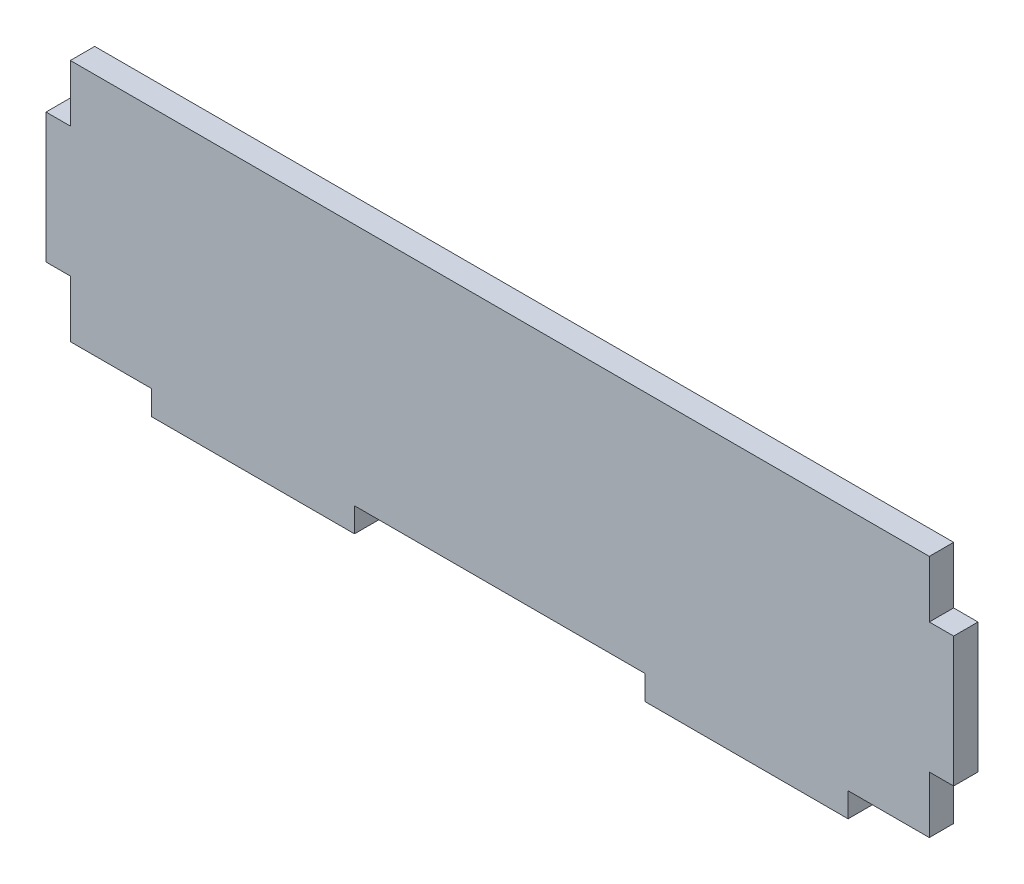
ISO-10303-21;
HEADER;
FILE_DESCRIPTION(('STEP AP214'),'2;1');
FILE_NAME('part.step','',(''),(''),'','','');
FILE_SCHEMA(('AUTOMOTIVE_DESIGN { 1 0 10303 214 1 1 1 1 }'));
ENDSEC;
DATA;
#1=APPLICATION_CONTEXT('core data for automotive mechanical design processes');
#2=APPLICATION_PROTOCOL_DEFINITION('international standard','automotive_design',2000,#1);
#3=PRODUCT_CONTEXT('',#1,'mechanical');
#4=PRODUCT('Part','Part','',(#3));
#5=PRODUCT_RELATED_PRODUCT_CATEGORY('part','',(#4));
#6=PRODUCT_DEFINITION_FORMATION('','',#4);
#7=PRODUCT_DEFINITION_CONTEXT('part definition',#1,'design');
#8=PRODUCT_DEFINITION('design','',#6,#7);
#9=PRODUCT_DEFINITION_SHAPE('','',#8);
#10=(LENGTH_UNIT() NAMED_UNIT(*) SI_UNIT(.MILLI.,.METRE.));
#11=(NAMED_UNIT(*) PLANE_ANGLE_UNIT() SI_UNIT($,.RADIAN.));
#12=(NAMED_UNIT(*) SI_UNIT($,.STERADIAN.) SOLID_ANGLE_UNIT());
#13=UNCERTAINTY_MEASURE_WITH_UNIT(LENGTH_MEASURE(1.E-05),#10,'distance_accuracy_value','');
#14=(GEOMETRIC_REPRESENTATION_CONTEXT(3) GLOBAL_UNCERTAINTY_ASSIGNED_CONTEXT((#13)) GLOBAL_UNIT_ASSIGNED_CONTEXT((#10,
#11,#12)) REPRESENTATION_CONTEXT('',''));
#15=CARTESIAN_POINT('',(0.,0.,0.));
#16=DIRECTION('',(0.,0.,1.));
#17=DIRECTION('',(1.,0.,0.));
#18=AXIS2_PLACEMENT_3D('',#15,#16,#17);
#19=CARTESIAN_POINT('',(0.,7.,3.));
#20=DIRECTION('',(0.,-1.,0.));
#21=DIRECTION('',(0.,0.,-1.));
#22=AXIS2_PLACEMENT_3D('',#19,#20,#21);
#23=PLANE('',#22);
#24=DIRECTION('',(-1.,0.,0.));
#25=VECTOR('',#24,1.);
#26=CARTESIAN_POINT('',(0.,7.,0.));
#27=LINE('',#26,#25);
#28=CARTESIAN_POINT('',(6.50000000000001,7.,0.));
#29=VERTEX_POINT('',#28);
#30=CARTESIAN_POINT('',(3.50000000000001,7.,0.));
#31=VERTEX_POINT('',#30);
#32=EDGE_CURVE('E214',#29,#31,#27,.T.);
#33=ORIENTED_EDGE('',*,*,#32,.F.);
#34=DIRECTION('',(0.,0.,-1.));
#35=VECTOR('',#34,1.);
#36=CARTESIAN_POINT('',(6.50000000000001,7.,3.));
#37=LINE('',#36,#35);
#38=CARTESIAN_POINT('',(6.50000000000001,7.,3.));
#39=VERTEX_POINT('',#38);
#40=EDGE_CURVE('E11',#39,#29,#37,.T.);
#41=ORIENTED_EDGE('',*,*,#40,.F.);
#42=DIRECTION('',(-1.,0.,0.));
#43=VECTOR('',#42,1.);
#44=CARTESIAN_POINT('',(0.,7.,3.));
#45=LINE('',#44,#43);
#46=CARTESIAN_POINT('',(3.50000000000001,7.,3.));
#47=VERTEX_POINT('',#46);
#48=EDGE_CURVE('E287',#39,#47,#45,.T.);
#49=ORIENTED_EDGE('',*,*,#48,.T.);
#50=DIRECTION('',(0.,0.,-1.));
#51=VECTOR('',#50,1.);
#52=CARTESIAN_POINT('',(3.50000000000001,7.,3.));
#53=LINE('',#52,#51);
#54=EDGE_CURVE('E58',#47,#31,#53,.T.);
#55=ORIENTED_EDGE('',*,*,#54,.T.);
#56=EDGE_LOOP('',(#33,#41,#49,#55));
#57=FACE_BOUND('',#56,.T.);
#58=ADVANCED_FACE('F41',(#57),#23,.T.);
#59=CARTESIAN_POINT('',(6.50000000000001,0.,3.));
#60=DIRECTION('',(1.,0.,0.));
#61=DIRECTION('',(0.,0.,-1.));
#62=AXIS2_PLACEMENT_3D('',#59,#60,#61);
#63=PLANE('',#62);
#64=DIRECTION('',(0.,-1.,0.));
#65=VECTOR('',#64,1.);
#66=CARTESIAN_POINT('',(6.50000000000001,0.,0.));
#67=LINE('',#66,#65);
#68=CARTESIAN_POINT('',(6.50000000000001,0.,0.));
#69=VERTEX_POINT('',#68);
#70=EDGE_CURVE('E217',#29,#69,#67,.T.);
#71=ORIENTED_EDGE('',*,*,#70,.T.);
#72=DIRECTION('',(0.,0.,-1.));
#73=VECTOR('',#72,1.);
#74=CARTESIAN_POINT('',(6.50000000000001,0.,3.));
#75=LINE('',#74,#73);
#76=CARTESIAN_POINT('',(6.50000000000001,0.,3.));
#77=VERTEX_POINT('',#76);
#78=EDGE_CURVE('E50',#77,#69,#75,.T.);
#79=ORIENTED_EDGE('',*,*,#78,.F.);
#80=DIRECTION('',(0.,-1.,0.));
#81=VECTOR('',#80,1.);
#82=CARTESIAN_POINT('',(6.50000000000001,0.,3.));
#83=LINE('',#82,#81);
#84=EDGE_CURVE('E366',#39,#77,#83,.T.);
#85=ORIENTED_EDGE('',*,*,#84,.F.);
#86=ORIENTED_EDGE('',*,*,#40,.T.);
#87=EDGE_LOOP('',(#71,#79,#85,#86));
#88=FACE_BOUND('',#87,.T.);
#89=ADVANCED_FACE('F426',(#88),#63,.F.);
#90=CARTESIAN_POINT('',(0.,0.,3.));
#91=DIRECTION('',(0.,1.,0.));
#92=DIRECTION('',(0.,0.,1.));
#93=AXIS2_PLACEMENT_3D('',#90,#91,#92);
#94=PLANE('',#93);
#95=DIRECTION('',(1.,0.,0.));
#96=VECTOR('',#95,1.);
#97=CARTESIAN_POINT('',(0.,0.,0.));
#98=LINE('',#97,#96);
#99=CARTESIAN_POINT('',(16.5,0.,0.));
#100=VERTEX_POINT('',#99);
#101=EDGE_CURVE('E220',#69,#100,#98,.T.);
#102=ORIENTED_EDGE('',*,*,#101,.T.);
#103=DIRECTION('',(0.,0.,-1.));
#104=VECTOR('',#103,1.);
#105=CARTESIAN_POINT('',(16.5,0.,3.));
#106=LINE('',#105,#104);
#107=CARTESIAN_POINT('',(16.5,0.,3.));
#108=VERTEX_POINT('',#107);
#109=EDGE_CURVE('E334',#108,#100,#106,.T.);
#110=ORIENTED_EDGE('',*,*,#109,.F.);
#111=DIRECTION('',(1.,0.,0.));
#112=VECTOR('',#111,1.);
#113=CARTESIAN_POINT('',(0.,0.,3.));
#114=LINE('',#113,#112);
#115=EDGE_CURVE('E345',#77,#108,#114,.T.);
#116=ORIENTED_EDGE('',*,*,#115,.F.);
#117=ORIENTED_EDGE('',*,*,#78,.T.);
#118=EDGE_LOOP('',(#102,#110,#116,#117));
#119=FACE_BOUND('',#118,.T.);
#120=ADVANCED_FACE('F343',(#119),#94,.F.);
#121=CARTESIAN_POINT('',(16.5,0.,3.));
#122=DIRECTION('',(1.,0.,0.));
#123=DIRECTION('',(0.,0.,-1.));
#124=AXIS2_PLACEMENT_3D('',#121,#122,#123);
#125=PLANE('',#124);
#126=DIRECTION('',(0.,-1.,0.));
#127=VECTOR('',#126,1.);
#128=CARTESIAN_POINT('',(16.5,0.,0.));
#129=LINE('',#128,#127);
#130=CARTESIAN_POINT('',(16.5,-3.,0.));
#131=VERTEX_POINT('',#130);
#132=EDGE_CURVE('E223',#100,#131,#129,.T.);
#133=ORIENTED_EDGE('',*,*,#132,.T.);
#134=DIRECTION('',(0.,0.,-1.));
#135=VECTOR('',#134,1.);
#136=CARTESIAN_POINT('',(16.5,-3.,3.));
#137=LINE('',#136,#135);
#138=CARTESIAN_POINT('',(16.5,-3.,3.));
#139=VERTEX_POINT('',#138);
#140=EDGE_CURVE('E331',#139,#131,#137,.T.);
#141=ORIENTED_EDGE('',*,*,#140,.F.);
#142=DIRECTION('',(0.,-1.,0.));
#143=VECTOR('',#142,1.);
#144=CARTESIAN_POINT('',(16.5,0.,3.));
#145=LINE('',#144,#143);
#146=EDGE_CURVE('E357',#108,#139,#145,.T.);
#147=ORIENTED_EDGE('',*,*,#146,.F.);
#148=ORIENTED_EDGE('',*,*,#109,.T.);
#149=EDGE_LOOP('',(#133,#141,#147,#148));
#150=FACE_BOUND('',#149,.T.);
#151=ADVANCED_FACE('F354',(#150),#125,.F.);
#152=CARTESIAN_POINT('',(0.,-3.,3.));
#153=DIRECTION('',(0.,-1.,0.));
#154=DIRECTION('',(0.,0.,-1.));
#155=AXIS2_PLACEMENT_3D('',#152,#153,#154);
#156=PLANE('',#155);
#157=DIRECTION('',(-1.,0.,0.));
#158=VECTOR('',#157,1.);
#159=CARTESIAN_POINT('',(0.,-3.,0.));
#160=LINE('',#159,#158);
#161=CARTESIAN_POINT('',(41.5,-3.,0.));
#162=VERTEX_POINT('',#161);
#163=EDGE_CURVE('E227',#162,#131,#160,.T.);
#164=ORIENTED_EDGE('',*,*,#163,.F.);
#165=DIRECTION('',(0.,0.,-1.));
#166=VECTOR('',#165,1.);
#167=CARTESIAN_POINT('',(41.5,-3.,3.));
#168=LINE('',#167,#166);
#169=CARTESIAN_POINT('',(41.5,-3.,3.));
#170=VERTEX_POINT('',#169);
#171=EDGE_CURVE('E328',#170,#162,#168,.T.);
#172=ORIENTED_EDGE('',*,*,#171,.F.);
#173=DIRECTION('',(-1.,0.,0.));
#174=VECTOR('',#173,1.);
#175=CARTESIAN_POINT('',(0.,-3.,3.));
#176=LINE('',#175,#174);
#177=EDGE_CURVE('E360',#170,#139,#176,.T.);
#178=ORIENTED_EDGE('',*,*,#177,.T.);
#179=ORIENTED_EDGE('',*,*,#140,.T.);
#180=EDGE_LOOP('',(#164,#172,#178,#179));
#181=FACE_BOUND('',#180,.T.);
#182=ADVANCED_FACE('F437',(#181),#156,.T.);
#183=CARTESIAN_POINT('',(41.5,0.,3.));
#184=DIRECTION('',(1.,0.,0.));
#185=DIRECTION('',(0.,0.,-1.));
#186=AXIS2_PLACEMENT_3D('',#183,#184,#185);
#187=PLANE('',#186);
#188=DIRECTION('',(0.,-1.,0.));
#189=VECTOR('',#188,1.);
#190=CARTESIAN_POINT('',(41.5,0.,0.));
#191=LINE('',#190,#189);
#192=CARTESIAN_POINT('',(41.5,0.,0.));
#193=VERTEX_POINT('',#192);
#194=EDGE_CURVE('E231',#193,#162,#191,.T.);
#195=ORIENTED_EDGE('',*,*,#194,.F.);
#196=DIRECTION('',(0.,0.,-1.));
#197=VECTOR('',#196,1.);
#198=CARTESIAN_POINT('',(41.5,0.,3.));
#199=LINE('',#198,#197);
#200=CARTESIAN_POINT('',(41.5,0.,3.));
#201=VERTEX_POINT('',#200);
#202=EDGE_CURVE('E325',#201,#193,#199,.T.);
#203=ORIENTED_EDGE('',*,*,#202,.F.);
#204=DIRECTION('',(0.,-1.,0.));
#205=VECTOR('',#204,1.);
#206=CARTESIAN_POINT('',(41.5,0.,3.));
#207=LINE('',#206,#205);
#208=EDGE_CURVE('E364',#201,#170,#207,.T.);
#209=ORIENTED_EDGE('',*,*,#208,.T.);
#210=ORIENTED_EDGE('',*,*,#171,.T.);
#211=EDGE_LOOP('',(#195,#203,#209,#210));
#212=FACE_BOUND('',#211,.T.);
#213=ADVANCED_FACE('F440',(#212),#187,.T.);
#214=CARTESIAN_POINT('',(0.,0.,3.));
#215=DIRECTION('',(0.,-1.,0.));
#216=DIRECTION('',(0.,0.,-1.));
#217=AXIS2_PLACEMENT_3D('',#214,#215,#216);
#218=PLANE('',#217);
#219=DIRECTION('',(-1.,0.,0.));
#220=VECTOR('',#219,1.);
#221=CARTESIAN_POINT('',(0.,0.,0.));
#222=LINE('',#221,#220);
#223=CARTESIAN_POINT('',(77.3,0.,0.));
#224=VERTEX_POINT('',#223);
#225=EDGE_CURVE('E235',#224,#193,#222,.T.);
#226=ORIENTED_EDGE('',*,*,#225,.F.);
#227=DIRECTION('',(0.,0.,-1.));
#228=VECTOR('',#227,1.);
#229=CARTESIAN_POINT('',(77.3,0.,3.));
#230=LINE('',#229,#228);
#231=CARTESIAN_POINT('',(77.3,0.,3.));
#232=VERTEX_POINT('',#231);
#233=EDGE_CURVE('E322',#232,#224,#230,.T.);
#234=ORIENTED_EDGE('',*,*,#233,.F.);
#235=DIRECTION('',(-1.,0.,0.));
#236=VECTOR('',#235,1.);
#237=CARTESIAN_POINT('',(0.,0.,3.));
#238=LINE('',#237,#236);
#239=EDGE_CURVE('E373',#232,#201,#238,.T.);
#240=ORIENTED_EDGE('',*,*,#239,.T.);
#241=ORIENTED_EDGE('',*,*,#202,.T.);
#242=EDGE_LOOP('',(#226,#234,#240,#241));
#243=FACE_BOUND('',#242,.T.);
#244=ADVANCED_FACE('F444',(#243),#218,.T.);
#245=CARTESIAN_POINT('',(77.3,0.,3.));
#246=DIRECTION('',(1.,0.,0.));
#247=DIRECTION('',(0.,0.,-1.));
#248=AXIS2_PLACEMENT_3D('',#245,#246,#247);
#249=PLANE('',#248);
#250=DIRECTION('',(0.,-1.,0.));
#251=VECTOR('',#250,1.);
#252=CARTESIAN_POINT('',(77.3,0.,0.));
#253=LINE('',#252,#251);
#254=CARTESIAN_POINT('',(77.3,-3.,0.));
#255=VERTEX_POINT('',#254);
#256=EDGE_CURVE('E239',#224,#255,#253,.T.);
#257=ORIENTED_EDGE('',*,*,#256,.T.);
#258=DIRECTION('',(0.,0.,-1.));
#259=VECTOR('',#258,1.);
#260=CARTESIAN_POINT('',(77.3,-3.,3.));
#261=LINE('',#260,#259);
#262=CARTESIAN_POINT('',(77.3,-3.,3.));
#263=VERTEX_POINT('',#262);
#264=EDGE_CURVE('E318',#263,#255,#261,.T.);
#265=ORIENTED_EDGE('',*,*,#264,.F.);
#266=DIRECTION('',(0.,-1.,0.));
#267=VECTOR('',#266,1.);
#268=CARTESIAN_POINT('',(77.3,0.,3.));
#269=LINE('',#268,#267);
#270=EDGE_CURVE('E377',#232,#263,#269,.T.);
#271=ORIENTED_EDGE('',*,*,#270,.F.);
#272=ORIENTED_EDGE('',*,*,#233,.T.);
#273=EDGE_LOOP('',(#257,#265,#271,#272));
#274=FACE_BOUND('',#273,.T.);
#275=ADVANCED_FACE('F448',(#274),#249,.F.);
#276=CARTESIAN_POINT('',(0.,-3.,3.));
#277=DIRECTION('',(0.,1.,0.));
#278=DIRECTION('',(0.,0.,1.));
#279=AXIS2_PLACEMENT_3D('',#276,#277,#278);
#280=PLANE('',#279);
#281=DIRECTION('',(1.,0.,0.));
#282=VECTOR('',#281,1.);
#283=CARTESIAN_POINT('',(0.,-3.,0.));
#284=LINE('',#283,#282);
#285=CARTESIAN_POINT('',(102.3,-3.,0.));
#286=VERTEX_POINT('',#285);
#287=EDGE_CURVE('E242',#255,#286,#284,.T.);
#288=ORIENTED_EDGE('',*,*,#287,.T.);
#289=DIRECTION('',(0.,0.,-1.));
#290=VECTOR('',#289,1.);
#291=CARTESIAN_POINT('',(102.3,-3.,3.));
#292=LINE('',#291,#290);
#293=CARTESIAN_POINT('',(102.3,-3.,3.));
#294=VERTEX_POINT('',#293);
#295=EDGE_CURVE('E315',#294,#286,#292,.T.);
#296=ORIENTED_EDGE('',*,*,#295,.F.);
#297=DIRECTION('',(1.,0.,0.));
#298=VECTOR('',#297,1.);
#299=CARTESIAN_POINT('',(0.,-3.,3.));
#300=LINE('',#299,#298);
#301=EDGE_CURVE('E380',#263,#294,#300,.T.);
#302=ORIENTED_EDGE('',*,*,#301,.F.);
#303=ORIENTED_EDGE('',*,*,#264,.T.);
#304=EDGE_LOOP('',(#288,#296,#302,#303));
#305=FACE_BOUND('',#304,.T.);
#306=ADVANCED_FACE('F452',(#305),#280,.F.);
#307=CARTESIAN_POINT('',(102.3,0.,3.));
#308=DIRECTION('',(1.,0.,0.));
#309=DIRECTION('',(0.,0.,-1.));
#310=AXIS2_PLACEMENT_3D('',#307,#308,#309);
#311=PLANE('',#310);
#312=DIRECTION('',(0.,-1.,0.));
#313=VECTOR('',#312,1.);
#314=CARTESIAN_POINT('',(102.3,0.,0.));
#315=LINE('',#314,#313);
#316=CARTESIAN_POINT('',(102.3,0.,0.));
#317=VERTEX_POINT('',#316);
#318=EDGE_CURVE('E246',#317,#286,#315,.T.);
#319=ORIENTED_EDGE('',*,*,#318,.F.);
#320=DIRECTION('',(0.,0.,-1.));
#321=VECTOR('',#320,1.);
#322=CARTESIAN_POINT('',(102.3,0.,3.));
#323=LINE('',#322,#321);
#324=CARTESIAN_POINT('',(102.3,0.,3.));
#325=VERTEX_POINT('',#324);
#326=EDGE_CURVE('E312',#325,#317,#323,.T.);
#327=ORIENTED_EDGE('',*,*,#326,.F.);
#328=DIRECTION('',(0.,-1.,0.));
#329=VECTOR('',#328,1.);
#330=CARTESIAN_POINT('',(102.3,0.,3.));
#331=LINE('',#330,#329);
#332=EDGE_CURVE('E383',#325,#294,#331,.T.);
#333=ORIENTED_EDGE('',*,*,#332,.T.);
#334=ORIENTED_EDGE('',*,*,#295,.T.);
#335=EDGE_LOOP('',(#319,#327,#333,#334));
#336=FACE_BOUND('',#335,.T.);
#337=ADVANCED_FACE('F456',(#336),#311,.T.);
#338=CARTESIAN_POINT('',(0.,0.,3.));
#339=DIRECTION('',(0.,1.,0.));
#340=DIRECTION('',(0.,0.,1.));
#341=AXIS2_PLACEMENT_3D('',#338,#339,#340);
#342=PLANE('',#341);
#343=DIRECTION('',(1.,0.,0.));
#344=VECTOR('',#343,1.);
#345=CARTESIAN_POINT('',(0.,0.,0.));
#346=LINE('',#345,#344);
#347=CARTESIAN_POINT('',(112.3,0.,0.));
#348=VERTEX_POINT('',#347);
#349=EDGE_CURVE('E250',#317,#348,#346,.T.);
#350=ORIENTED_EDGE('',*,*,#349,.T.);
#351=DIRECTION('',(0.,0.,-1.));
#352=VECTOR('',#351,1.);
#353=CARTESIAN_POINT('',(112.3,0.,3.));
#354=LINE('',#353,#352);
#355=CARTESIAN_POINT('',(112.3,0.,3.));
#356=VERTEX_POINT('',#355);
#357=EDGE_CURVE('E309',#356,#348,#354,.T.);
#358=ORIENTED_EDGE('',*,*,#357,.F.);
#359=DIRECTION('',(1.,0.,0.));
#360=VECTOR('',#359,1.);
#361=CARTESIAN_POINT('',(0.,0.,3.));
#362=LINE('',#361,#360);
#363=EDGE_CURVE('E387',#325,#356,#362,.T.);
#364=ORIENTED_EDGE('',*,*,#363,.F.);
#365=ORIENTED_EDGE('',*,*,#326,.T.);
#366=EDGE_LOOP('',(#350,#358,#364,#365));
#367=FACE_BOUND('',#366,.T.);
#368=ADVANCED_FACE('F460',(#367),#342,.F.);
#369=CARTESIAN_POINT('',(112.3,0.,3.));
#370=DIRECTION('',(1.,0.,0.));
#371=DIRECTION('',(0.,0.,-1.));
#372=AXIS2_PLACEMENT_3D('',#369,#370,#371);
#373=PLANE('',#372);
#374=DIRECTION('',(0.,-1.,0.));
#375=VECTOR('',#374,1.);
#376=CARTESIAN_POINT('',(112.3,0.,0.));
#377=LINE('',#376,#375);
#378=CARTESIAN_POINT('',(112.3,7.,0.));
#379=VERTEX_POINT('',#378);
#380=EDGE_CURVE('E254',#379,#348,#377,.T.);
#381=ORIENTED_EDGE('',*,*,#380,.F.);
#382=DIRECTION('',(0.,0.,-1.));
#383=VECTOR('',#382,1.);
#384=CARTESIAN_POINT('',(112.3,7.,3.));
#385=LINE('',#384,#383);
#386=CARTESIAN_POINT('',(112.3,7.,3.));
#387=VERTEX_POINT('',#386);
#388=EDGE_CURVE('E306',#387,#379,#385,.T.);
#389=ORIENTED_EDGE('',*,*,#388,.F.);
#390=DIRECTION('',(0.,-1.,0.));
#391=VECTOR('',#390,1.);
#392=CARTESIAN_POINT('',(112.3,0.,3.));
#393=LINE('',#392,#391);
#394=EDGE_CURVE('E390',#387,#356,#393,.T.);
#395=ORIENTED_EDGE('',*,*,#394,.T.);
#396=ORIENTED_EDGE('',*,*,#357,.T.);
#397=EDGE_LOOP('',(#381,#389,#395,#396));
#398=FACE_BOUND('',#397,.T.);
#399=ADVANCED_FACE('F464',(#398),#373,.T.);
#400=CARTESIAN_POINT('',(0.,7.,3.));
#401=DIRECTION('',(0.,1.,0.));
#402=DIRECTION('',(0.,0.,1.));
#403=AXIS2_PLACEMENT_3D('',#400,#401,#402);
#404=PLANE('',#403);
#405=DIRECTION('',(1.,0.,0.));
#406=VECTOR('',#405,1.);
#407=CARTESIAN_POINT('',(0.,7.,0.));
#408=LINE('',#407,#406);
#409=CARTESIAN_POINT('',(115.3,7.,0.));
#410=VERTEX_POINT('',#409);
#411=EDGE_CURVE('E258',#379,#410,#408,.T.);
#412=ORIENTED_EDGE('',*,*,#411,.T.);
#413=DIRECTION('',(0.,0.,-1.));
#414=VECTOR('',#413,1.);
#415=CARTESIAN_POINT('',(115.3,7.,3.));
#416=LINE('',#415,#414);
#417=CARTESIAN_POINT('',(115.3,7.,3.));
#418=VERTEX_POINT('',#417);
#419=EDGE_CURVE('E303',#418,#410,#416,.T.);
#420=ORIENTED_EDGE('',*,*,#419,.F.);
#421=DIRECTION('',(1.,0.,0.));
#422=VECTOR('',#421,1.);
#423=CARTESIAN_POINT('',(0.,7.,3.));
#424=LINE('',#423,#422);
#425=EDGE_CURVE('E394',#387,#418,#424,.T.);
#426=ORIENTED_EDGE('',*,*,#425,.F.);
#427=ORIENTED_EDGE('',*,*,#388,.T.);
#428=EDGE_LOOP('',(#412,#420,#426,#427));
#429=FACE_BOUND('',#428,.T.);
#430=ADVANCED_FACE('F468',(#429),#404,.F.);
#431=CARTESIAN_POINT('',(115.3,0.,3.));
#432=DIRECTION('',(1.,0.,0.));
#433=DIRECTION('',(0.,0.,-1.));
#434=AXIS2_PLACEMENT_3D('',#431,#432,#433);
#435=PLANE('',#434);
#436=DIRECTION('',(0.,-1.,0.));
#437=VECTOR('',#436,1.);
#438=CARTESIAN_POINT('',(115.3,0.,0.));
#439=LINE('',#438,#437);
#440=CARTESIAN_POINT('',(115.3,23.,0.));
#441=VERTEX_POINT('',#440);
#442=EDGE_CURVE('E262',#441,#410,#439,.T.);
#443=ORIENTED_EDGE('',*,*,#442,.F.);
#444=DIRECTION('',(0.,0.,-1.));
#445=VECTOR('',#444,1.);
#446=CARTESIAN_POINT('',(115.3,23.,3.));
#447=LINE('',#446,#445);
#448=CARTESIAN_POINT('',(115.3,23.,3.));
#449=VERTEX_POINT('',#448);
#450=EDGE_CURVE('E300',#449,#441,#447,.T.);
#451=ORIENTED_EDGE('',*,*,#450,.F.);
#452=DIRECTION('',(0.,-1.,0.));
#453=VECTOR('',#452,1.);
#454=CARTESIAN_POINT('',(115.3,0.,3.));
#455=LINE('',#454,#453);
#456=EDGE_CURVE('E397',#449,#418,#455,.T.);
#457=ORIENTED_EDGE('',*,*,#456,.T.);
#458=ORIENTED_EDGE('',*,*,#419,.T.);
#459=EDGE_LOOP('',(#443,#451,#457,#458));
#460=FACE_BOUND('',#459,.T.);
#461=ADVANCED_FACE('F472',(#460),#435,.T.);
#462=CARTESIAN_POINT('',(0.,23.,3.));
#463=DIRECTION('',(0.,1.,0.));
#464=DIRECTION('',(0.,0.,1.));
#465=AXIS2_PLACEMENT_3D('',#462,#463,#464);
#466=PLANE('',#465);
#467=DIRECTION('',(1.,0.,0.));
#468=VECTOR('',#467,1.);
#469=CARTESIAN_POINT('',(0.,23.,0.));
#470=LINE('',#469,#468);
#471=CARTESIAN_POINT('',(112.3,23.,0.));
#472=VERTEX_POINT('',#471);
#473=EDGE_CURVE('E266',#472,#441,#470,.T.);
#474=ORIENTED_EDGE('',*,*,#473,.F.);
#475=DIRECTION('',(0.,0.,-1.));
#476=VECTOR('',#475,1.);
#477=CARTESIAN_POINT('',(112.3,23.,3.));
#478=LINE('',#477,#476);
#479=CARTESIAN_POINT('',(112.3,23.,3.));
#480=VERTEX_POINT('',#479);
#481=EDGE_CURVE('E297',#480,#472,#478,.T.);
#482=ORIENTED_EDGE('',*,*,#481,.F.);
#483=DIRECTION('',(1.,0.,0.));
#484=VECTOR('',#483,1.);
#485=CARTESIAN_POINT('',(0.,23.,3.));
#486=LINE('',#485,#484);
#487=EDGE_CURVE('E401',#480,#449,#486,.T.);
#488=ORIENTED_EDGE('',*,*,#487,.T.);
#489=ORIENTED_EDGE('',*,*,#450,.T.);
#490=EDGE_LOOP('',(#474,#482,#488,#489));
#491=FACE_BOUND('',#490,.T.);
#492=ADVANCED_FACE('F476',(#491),#466,.T.);
#493=CARTESIAN_POINT('',(112.3,0.,3.));
#494=DIRECTION('',(-1.,0.,0.));
#495=DIRECTION('',(0.,0.,1.));
#496=AXIS2_PLACEMENT_3D('',#493,#494,#495);
#497=PLANE('',#496);
#498=DIRECTION('',(0.,1.,0.));
#499=VECTOR('',#498,1.);
#500=CARTESIAN_POINT('',(112.3,0.,0.));
#501=LINE('',#500,#499);
#502=CARTESIAN_POINT('',(112.3,30.,0.));
#503=VERTEX_POINT('',#502);
#504=EDGE_CURVE('E270',#472,#503,#501,.T.);
#505=ORIENTED_EDGE('',*,*,#504,.T.);
#506=DIRECTION('',(0.,0.,-1.));
#507=VECTOR('',#506,1.);
#508=CARTESIAN_POINT('',(112.3,30.,3.));
#509=LINE('',#508,#507);
#510=CARTESIAN_POINT('',(112.3,30.,3.));
#511=VERTEX_POINT('',#510);
#512=EDGE_CURVE('E294',#511,#503,#509,.T.);
#513=ORIENTED_EDGE('',*,*,#512,.F.);
#514=DIRECTION('',(0.,1.,0.));
#515=VECTOR('',#514,1.);
#516=CARTESIAN_POINT('',(112.3,0.,3.));
#517=LINE('',#516,#515);
#518=EDGE_CURVE('E208',#480,#511,#517,.T.);
#519=ORIENTED_EDGE('',*,*,#518,.F.);
#520=ORIENTED_EDGE('',*,*,#481,.T.);
#521=EDGE_LOOP('',(#505,#513,#519,#520));
#522=FACE_BOUND('',#521,.T.);
#523=ADVANCED_FACE('F410',(#522),#497,.F.);
#524=CARTESIAN_POINT('',(0.,30.,3.));
#525=DIRECTION('',(0.,1.,0.));
#526=DIRECTION('',(0.,0.,1.));
#527=AXIS2_PLACEMENT_3D('',#524,#525,#526);
#528=PLANE('',#527);
#529=DIRECTION('',(1.,0.,0.));
#530=VECTOR('',#529,1.);
#531=CARTESIAN_POINT('',(0.,30.,0.));
#532=LINE('',#531,#530);
#533=CARTESIAN_POINT('',(6.50000000000001,30.,0.));
#534=VERTEX_POINT('',#533);
#535=EDGE_CURVE('E274',#534,#503,#532,.T.);
#536=ORIENTED_EDGE('',*,*,#535,.F.);
#537=DIRECTION('',(0.,0.,-1.));
#538=VECTOR('',#537,1.);
#539=CARTESIAN_POINT('',(6.50000000000001,30.,3.));
#540=LINE('',#539,#538);
#541=CARTESIAN_POINT('',(6.50000000000001,30.,3.));
#542=VERTEX_POINT('',#541);
#543=EDGE_CURVE('E191',#542,#534,#540,.T.);
#544=ORIENTED_EDGE('',*,*,#543,.F.);
#545=DIRECTION('',(1.,0.,0.));
#546=VECTOR('',#545,1.);
#547=CARTESIAN_POINT('',(0.,30.,3.));
#548=LINE('',#547,#546);
#549=EDGE_CURVE('E204',#542,#511,#548,.T.);
#550=ORIENTED_EDGE('',*,*,#549,.T.);
#551=ORIENTED_EDGE('',*,*,#512,.T.);
#552=EDGE_LOOP('',(#536,#544,#550,#551));
#553=FACE_BOUND('',#552,.T.);
#554=ADVANCED_FACE('F414',(#553),#528,.T.);
#555=CARTESIAN_POINT('',(6.50000000000001,0.,3.));
#556=DIRECTION('',(-1.,0.,0.));
#557=DIRECTION('',(0.,0.,1.));
#558=AXIS2_PLACEMENT_3D('',#555,#556,#557);
#559=PLANE('',#558);
#560=DIRECTION('',(0.,1.,0.));
#561=VECTOR('',#560,1.);
#562=CARTESIAN_POINT('',(6.50000000000001,0.,0.));
#563=LINE('',#562,#561);
#564=CARTESIAN_POINT('',(6.50000000000001,23.,0.));
#565=VERTEX_POINT('',#564);
#566=EDGE_CURVE('E187',#565,#534,#563,.T.);
#567=ORIENTED_EDGE('',*,*,#566,.F.);
#568=DIRECTION('',(0.,0.,-1.));
#569=VECTOR('',#568,1.);
#570=CARTESIAN_POINT('',(6.50000000000001,23.,3.));
#571=LINE('',#570,#569);
#572=CARTESIAN_POINT('',(6.50000000000001,23.,3.));
#573=VERTEX_POINT('',#572);
#574=EDGE_CURVE('E181',#573,#565,#571,.T.);
#575=ORIENTED_EDGE('',*,*,#574,.F.);
#576=DIRECTION('',(0.,1.,0.));
#577=VECTOR('',#576,1.);
#578=CARTESIAN_POINT('',(6.50000000000001,0.,3.));
#579=LINE('',#578,#577);
#580=EDGE_CURVE('E185',#573,#542,#579,.T.);
#581=ORIENTED_EDGE('',*,*,#580,.T.);
#582=ORIENTED_EDGE('',*,*,#543,.T.);
#583=EDGE_LOOP('',(#567,#575,#581,#582));
#584=FACE_BOUND('',#583,.T.);
#585=ADVANCED_FACE('F183',(#584),#559,.T.);
#586=CARTESIAN_POINT('',(0.,23.,3.));
#587=DIRECTION('',(0.,-1.,0.));
#588=DIRECTION('',(0.,0.,-1.));
#589=AXIS2_PLACEMENT_3D('',#586,#587,#588);
#590=PLANE('',#589);
#591=DIRECTION('',(-1.,0.,0.));
#592=VECTOR('',#591,1.);
#593=CARTESIAN_POINT('',(0.,23.,0.));
#594=LINE('',#593,#592);
#595=CARTESIAN_POINT('',(3.50000000000001,23.,0.));
#596=VERTEX_POINT('',#595);
#597=EDGE_CURVE('E280',#565,#596,#594,.T.);
#598=ORIENTED_EDGE('',*,*,#597,.T.);
#599=DIRECTION('',(0.,0.,-1.));
#600=VECTOR('',#599,1.);
#601=CARTESIAN_POINT('',(3.50000000000001,23.,3.));
#602=LINE('',#601,#600);
#603=CARTESIAN_POINT('',(3.50000000000001,23.,3.));
#604=VERTEX_POINT('',#603);
#605=EDGE_CURVE('E120',#604,#596,#602,.T.);
#606=ORIENTED_EDGE('',*,*,#605,.F.);
#607=DIRECTION('',(-1.,0.,0.));
#608=VECTOR('',#607,1.);
#609=CARTESIAN_POINT('',(0.,23.,3.));
#610=LINE('',#609,#608);
#611=EDGE_CURVE('E193',#573,#604,#610,.T.);
#612=ORIENTED_EDGE('',*,*,#611,.F.);
#613=ORIENTED_EDGE('',*,*,#574,.T.);
#614=EDGE_LOOP('',(#598,#606,#612,#613));
#615=FACE_BOUND('',#614,.T.);
#616=ADVANCED_FACE('F194',(#615),#590,.F.);
#617=CARTESIAN_POINT('',(3.50000000000001,0.,3.));
#618=DIRECTION('',(-1.,0.,0.));
#619=DIRECTION('',(0.,0.,1.));
#620=AXIS2_PLACEMENT_3D('',#617,#618,#619);
#621=PLANE('',#620);
#622=DIRECTION('',(0.,1.,0.));
#623=VECTOR('',#622,1.);
#624=CARTESIAN_POINT('',(3.50000000000001,0.,0.));
#625=LINE('',#624,#623);
#626=EDGE_CURVE('E283',#31,#596,#625,.T.);
#627=ORIENTED_EDGE('',*,*,#626,.F.);
#628=ORIENTED_EDGE('',*,*,#54,.F.);
#629=DIRECTION('',(0.,1.,0.));
#630=VECTOR('',#629,1.);
#631=CARTESIAN_POINT('',(3.50000000000001,0.,3.));
#632=LINE('',#631,#630);
#633=EDGE_CURVE('E198',#47,#604,#632,.T.);
#634=ORIENTED_EDGE('',*,*,#633,.T.);
#635=ORIENTED_EDGE('',*,*,#605,.T.);
#636=EDGE_LOOP('',(#627,#628,#634,#635));
#637=FACE_BOUND('',#636,.T.);
#638=ADVANCED_FACE('F415',(#637),#621,.T.);
#639=CARTESIAN_POINT('',(0.,0.,3.));
#640=DIRECTION('',(0.,0.,1.));
#641=DIRECTION('',(1.,0.,0.));
#642=AXIS2_PLACEMENT_3D('',#639,#640,#641);
#643=PLANE('',#642);
#644=ORIENTED_EDGE('',*,*,#48,.F.);
#645=ORIENTED_EDGE('',*,*,#84,.T.);
#646=ORIENTED_EDGE('',*,*,#115,.T.);
#647=ORIENTED_EDGE('',*,*,#146,.T.);
#648=ORIENTED_EDGE('',*,*,#177,.F.);
#649=ORIENTED_EDGE('',*,*,#208,.F.);
#650=ORIENTED_EDGE('',*,*,#239,.F.);
#651=ORIENTED_EDGE('',*,*,#270,.T.);
#652=ORIENTED_EDGE('',*,*,#301,.T.);
#653=ORIENTED_EDGE('',*,*,#332,.F.);
#654=ORIENTED_EDGE('',*,*,#363,.T.);
#655=ORIENTED_EDGE('',*,*,#394,.F.);
#656=ORIENTED_EDGE('',*,*,#425,.T.);
#657=ORIENTED_EDGE('',*,*,#456,.F.);
#658=ORIENTED_EDGE('',*,*,#487,.F.);
#659=ORIENTED_EDGE('',*,*,#518,.T.);
#660=ORIENTED_EDGE('',*,*,#549,.F.);
#661=ORIENTED_EDGE('',*,*,#580,.F.);
#662=ORIENTED_EDGE('',*,*,#611,.T.);
#663=ORIENTED_EDGE('',*,*,#633,.F.);
#664=EDGE_LOOP('',(#644,#645,#646,#647,#648,#649,#650,#651,#652,#653,#654,#655,#656,#657,#658,
#659,#660,#661,#662,#663));
#665=FACE_BOUND('',#664,.T.);
#666=ADVANCED_FACE('F202',(#665),#643,.T.);
#667=CARTESIAN_POINT('',(0.,0.,0.));
#668=DIRECTION('',(0.,0.,1.));
#669=DIRECTION('',(1.,0.,0.));
#670=AXIS2_PLACEMENT_3D('',#667,#668,#669);
#671=PLANE('',#670);
#672=ORIENTED_EDGE('',*,*,#32,.T.);
#673=ORIENTED_EDGE('',*,*,#626,.T.);
#674=ORIENTED_EDGE('',*,*,#597,.F.);
#675=ORIENTED_EDGE('',*,*,#566,.T.);
#676=ORIENTED_EDGE('',*,*,#535,.T.);
#677=ORIENTED_EDGE('',*,*,#504,.F.);
#678=ORIENTED_EDGE('',*,*,#473,.T.);
#679=ORIENTED_EDGE('',*,*,#442,.T.);
#680=ORIENTED_EDGE('',*,*,#411,.F.);
#681=ORIENTED_EDGE('',*,*,#380,.T.);
#682=ORIENTED_EDGE('',*,*,#349,.F.);
#683=ORIENTED_EDGE('',*,*,#318,.T.);
#684=ORIENTED_EDGE('',*,*,#287,.F.);
#685=ORIENTED_EDGE('',*,*,#256,.F.);
#686=ORIENTED_EDGE('',*,*,#225,.T.);
#687=ORIENTED_EDGE('',*,*,#194,.T.);
#688=ORIENTED_EDGE('',*,*,#163,.T.);
#689=ORIENTED_EDGE('',*,*,#132,.F.);
#690=ORIENTED_EDGE('',*,*,#101,.F.);
#691=ORIENTED_EDGE('',*,*,#70,.F.);
#692=EDGE_LOOP('',(#672,#673,#674,#675,#676,#677,#678,#679,#680,#681,#682,#683,#684,#685,#686,
#687,#688,#689,#690,#691));
#693=FACE_BOUND('',#692,.T.);
#694=ADVANCED_FACE('F350',(#693),#671,.F.);
#695=CLOSED_SHELL('',(#58,#89,#120,#151,#182,#213,#244,#275,#306,#337,#368,#399,#430,#461,#492,
#523,#554,#585,#616,#638,#666,#694));
#696=MANIFOLD_SOLID_BREP('B2',#695);
#697=ADVANCED_BREP_SHAPE_REPRESENTATION('',(#18,#696),#14);
#698=SHAPE_DEFINITION_REPRESENTATION(#9,#697);
ENDSEC;
END-ISO-10303-21;
